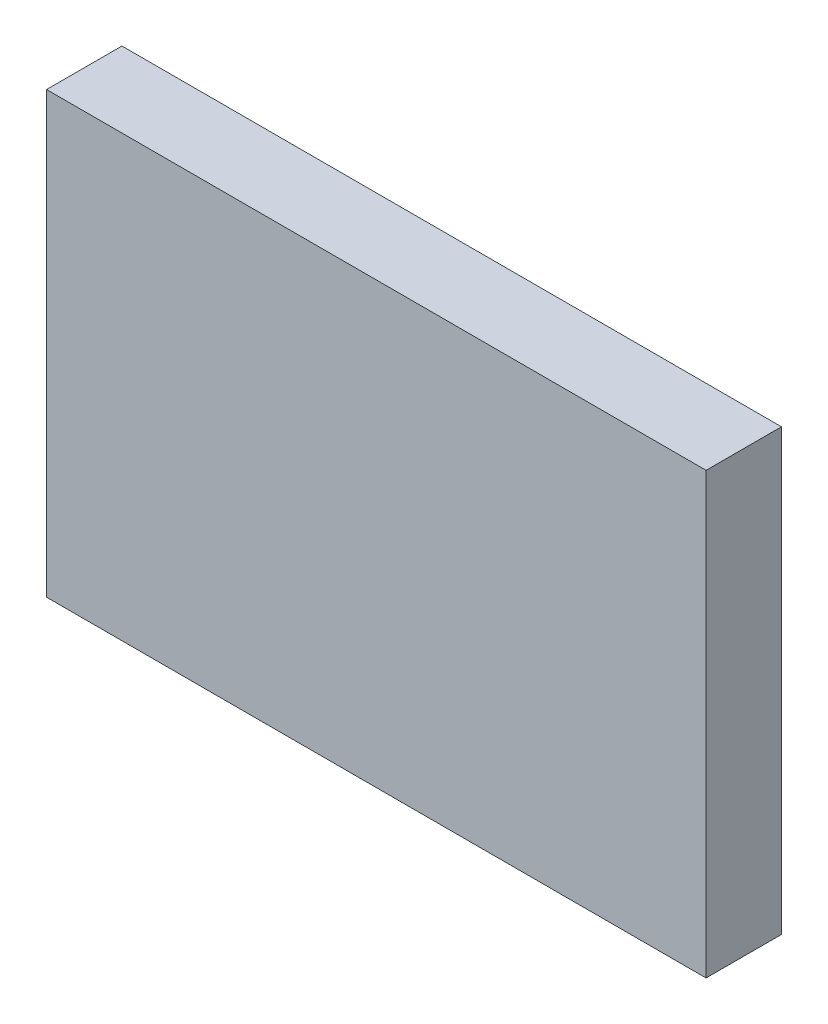
ISO-10303-21;
HEADER;
FILE_DESCRIPTION(('STEP AP214'),'2;1');
FILE_NAME('part.step','',(''),(''),'','','');
FILE_SCHEMA(('AUTOMOTIVE_DESIGN { 1 0 10303 214 1 1 1 1 }'));
ENDSEC;
DATA;
#1=APPLICATION_CONTEXT('core data for automotive mechanical design processes');
#2=APPLICATION_PROTOCOL_DEFINITION('international standard','automotive_design',2000,#1);
#3=PRODUCT_CONTEXT('',#1,'mechanical');
#4=PRODUCT('Part','Part','',(#3));
#5=PRODUCT_RELATED_PRODUCT_CATEGORY('part','',(#4));
#6=PRODUCT_DEFINITION_FORMATION('','',#4);
#7=PRODUCT_DEFINITION_CONTEXT('part definition',#1,'design');
#8=PRODUCT_DEFINITION('design','',#6,#7);
#9=PRODUCT_DEFINITION_SHAPE('','',#8);
#10=(LENGTH_UNIT() NAMED_UNIT(*) SI_UNIT(.MILLI.,.METRE.));
#11=(NAMED_UNIT(*) PLANE_ANGLE_UNIT() SI_UNIT($,.RADIAN.));
#12=(NAMED_UNIT(*) SI_UNIT($,.STERADIAN.) SOLID_ANGLE_UNIT());
#13=UNCERTAINTY_MEASURE_WITH_UNIT(LENGTH_MEASURE(1.E-05),#10,'distance_accuracy_value','');
#14=(GEOMETRIC_REPRESENTATION_CONTEXT(3) GLOBAL_UNCERTAINTY_ASSIGNED_CONTEXT((#13)) GLOBAL_UNIT_ASSIGNED_CONTEXT((#10,
#11,#12)) REPRESENTATION_CONTEXT('',''));
#15=CARTESIAN_POINT('',(0.,0.,0.));
#16=DIRECTION('',(0.,0.,1.));
#17=DIRECTION('',(1.,0.,0.));
#18=AXIS2_PLACEMENT_3D('',#15,#16,#17);
#19=CARTESIAN_POINT('',(0.,0.,9.6));
#20=DIRECTION('',(1.,0.,0.));
#21=DIRECTION('',(0.,0.,-1.));
#22=AXIS2_PLACEMENT_3D('',#19,#20,#21);
#23=PLANE('',#22);
#24=DIRECTION('',(0.,-1.,0.));
#25=VECTOR('',#24,1.);
#26=CARTESIAN_POINT('',(0.,0.,0.));
#27=LINE('',#26,#25);
#28=CARTESIAN_POINT('',(0.,56.,0.));
#29=VERTEX_POINT('',#28);
#30=CARTESIAN_POINT('',(0.,0.,0.));
#31=VERTEX_POINT('',#30);
#32=EDGE_CURVE('E95',#29,#31,#27,.T.);
#33=ORIENTED_EDGE('',*,*,#32,.T.);
#34=DIRECTION('',(0.,0.,-1.));
#35=VECTOR('',#34,1.);
#36=CARTESIAN_POINT('',(0.,0.,9.6));
#37=LINE('',#36,#35);
#38=CARTESIAN_POINT('',(0.,0.,9.6));
#39=VERTEX_POINT('',#38);
#40=EDGE_CURVE('E11',#39,#31,#37,.T.);
#41=ORIENTED_EDGE('',*,*,#40,.F.);
#42=DIRECTION('',(0.,-1.,0.));
#43=VECTOR('',#42,1.);
#44=CARTESIAN_POINT('',(0.,0.,9.6));
#45=LINE('',#44,#43);
#46=CARTESIAN_POINT('',(0.,56.,9.6));
#47=VERTEX_POINT('',#46);
#48=EDGE_CURVE('E83',#47,#39,#45,.T.);
#49=ORIENTED_EDGE('',*,*,#48,.F.);
#50=DIRECTION('',(0.,0.,-1.));
#51=VECTOR('',#50,1.);
#52=CARTESIAN_POINT('',(0.,56.,9.6));
#53=LINE('',#52,#51);
#54=EDGE_CURVE('E91',#47,#29,#53,.T.);
#55=ORIENTED_EDGE('',*,*,#54,.T.);
#56=EDGE_LOOP('',(#33,#41,#49,#55));
#57=FACE_BOUND('',#56,.T.);
#58=ADVANCED_FACE('F32',(#57),#23,.F.);
#59=CARTESIAN_POINT('',(0.,0.,9.6));
#60=DIRECTION('',(0.,1.,0.));
#61=DIRECTION('',(0.,0.,1.));
#62=AXIS2_PLACEMENT_3D('',#59,#60,#61);
#63=PLANE('',#62);
#64=DIRECTION('',(1.,0.,0.));
#65=VECTOR('',#64,1.);
#66=CARTESIAN_POINT('',(0.,0.,0.));
#67=LINE('',#66,#65);
#68=CARTESIAN_POINT('',(84.,0.,0.));
#69=VERTEX_POINT('',#68);
#70=EDGE_CURVE('E87',#31,#69,#67,.T.);
#71=ORIENTED_EDGE('',*,*,#70,.T.);
#72=DIRECTION('',(0.,0.,-1.));
#73=VECTOR('',#72,1.);
#74=CARTESIAN_POINT('',(84.,0.,9.6));
#75=LINE('',#74,#73);
#76=CARTESIAN_POINT('',(84.,0.,9.6));
#77=VERTEX_POINT('',#76);
#78=EDGE_CURVE('E40',#77,#69,#75,.T.);
#79=ORIENTED_EDGE('',*,*,#78,.F.);
#80=DIRECTION('',(1.,0.,0.));
#81=VECTOR('',#80,1.);
#82=CARTESIAN_POINT('',(0.,0.,9.6));
#83=LINE('',#82,#81);
#84=EDGE_CURVE('E78',#39,#77,#83,.T.);
#85=ORIENTED_EDGE('',*,*,#84,.F.);
#86=ORIENTED_EDGE('',*,*,#40,.T.);
#87=EDGE_LOOP('',(#71,#79,#85,#86));
#88=FACE_BOUND('',#87,.T.);
#89=ADVANCED_FACE('F86',(#88),#63,.F.);
#90=CARTESIAN_POINT('',(84.,0.,9.6));
#91=DIRECTION('',(-1.,0.,0.));
#92=DIRECTION('',(0.,0.,1.));
#93=AXIS2_PLACEMENT_3D('',#90,#91,#92);
#94=PLANE('',#93);
#95=DIRECTION('',(0.,1.,0.));
#96=VECTOR('',#95,1.);
#97=CARTESIAN_POINT('',(84.,0.,0.));
#98=LINE('',#97,#96);
#99=CARTESIAN_POINT('',(84.,56.,0.));
#100=VERTEX_POINT('',#99);
#101=EDGE_CURVE('E65',#69,#100,#98,.T.);
#102=ORIENTED_EDGE('',*,*,#101,.T.);
#103=DIRECTION('',(0.,0.,-1.));
#104=VECTOR('',#103,1.);
#105=CARTESIAN_POINT('',(84.,56.,9.6));
#106=LINE('',#105,#104);
#107=CARTESIAN_POINT('',(84.,56.,9.6));
#108=VERTEX_POINT('',#107);
#109=EDGE_CURVE('E88',#108,#100,#106,.T.);
#110=ORIENTED_EDGE('',*,*,#109,.F.);
#111=DIRECTION('',(0.,1.,0.));
#112=VECTOR('',#111,1.);
#113=CARTESIAN_POINT('',(84.,0.,9.6));
#114=LINE('',#113,#112);
#115=EDGE_CURVE('E81',#77,#108,#114,.T.);
#116=ORIENTED_EDGE('',*,*,#115,.F.);
#117=ORIENTED_EDGE('',*,*,#78,.T.);
#118=EDGE_LOOP('',(#102,#110,#116,#117));
#119=FACE_BOUND('',#118,.T.);
#120=ADVANCED_FACE('F89',(#119),#94,.F.);
#121=CARTESIAN_POINT('',(0.,56.,9.6));
#122=DIRECTION('',(0.,-1.,0.));
#123=DIRECTION('',(0.,0.,-1.));
#124=AXIS2_PLACEMENT_3D('',#121,#122,#123);
#125=PLANE('',#124);
#126=DIRECTION('',(-1.,0.,0.));
#127=VECTOR('',#126,1.);
#128=CARTESIAN_POINT('',(0.,56.,0.));
#129=LINE('',#128,#127);
#130=EDGE_CURVE('E71',#100,#29,#129,.T.);
#131=ORIENTED_EDGE('',*,*,#130,.T.);
#132=ORIENTED_EDGE('',*,*,#54,.F.);
#133=DIRECTION('',(-1.,0.,0.));
#134=VECTOR('',#133,1.);
#135=CARTESIAN_POINT('',(0.,56.,9.6));
#136=LINE('',#135,#134);
#137=EDGE_CURVE('E48',#108,#47,#136,.T.);
#138=ORIENTED_EDGE('',*,*,#137,.F.);
#139=ORIENTED_EDGE('',*,*,#109,.T.);
#140=EDGE_LOOP('',(#131,#132,#138,#139));
#141=FACE_BOUND('',#140,.T.);
#142=ADVANCED_FACE('F102',(#141),#125,.F.);
#143=CARTESIAN_POINT('',(0.,0.,9.6));
#144=DIRECTION('',(0.,0.,-1.));
#145=DIRECTION('',(-1.,0.,0.));
#146=AXIS2_PLACEMENT_3D('',#143,#144,#145);
#147=PLANE('',#146);
#148=ORIENTED_EDGE('',*,*,#48,.T.);
#149=ORIENTED_EDGE('',*,*,#84,.T.);
#150=ORIENTED_EDGE('',*,*,#115,.T.);
#151=ORIENTED_EDGE('',*,*,#137,.T.);
#152=EDGE_LOOP('',(#148,#149,#150,#151));
#153=FACE_BOUND('',#152,.T.);
#154=ADVANCED_FACE('F79',(#153),#147,.F.);
#155=CARTESIAN_POINT('',(0.,0.,0.));
#156=DIRECTION('',(0.,0.,-1.));
#157=DIRECTION('',(-1.,0.,0.));
#158=AXIS2_PLACEMENT_3D('',#155,#156,#157);
#159=PLANE('',#158);
#160=ORIENTED_EDGE('',*,*,#32,.F.);
#161=ORIENTED_EDGE('',*,*,#130,.F.);
#162=ORIENTED_EDGE('',*,*,#101,.F.);
#163=ORIENTED_EDGE('',*,*,#70,.F.);
#164=EDGE_LOOP('',(#160,#161,#162,#163));
#165=FACE_BOUND('',#164,.T.);
#166=ADVANCED_FACE('F105',(#165),#159,.T.);
#167=CLOSED_SHELL('',(#58,#89,#120,#142,#154,#166));
#168=MANIFOLD_SOLID_BREP('B2',#167);
#169=ADVANCED_BREP_SHAPE_REPRESENTATION('',(#18,#168),#14);
#170=SHAPE_DEFINITION_REPRESENTATION(#9,#169);
ENDSEC;
END-ISO-10303-21;
